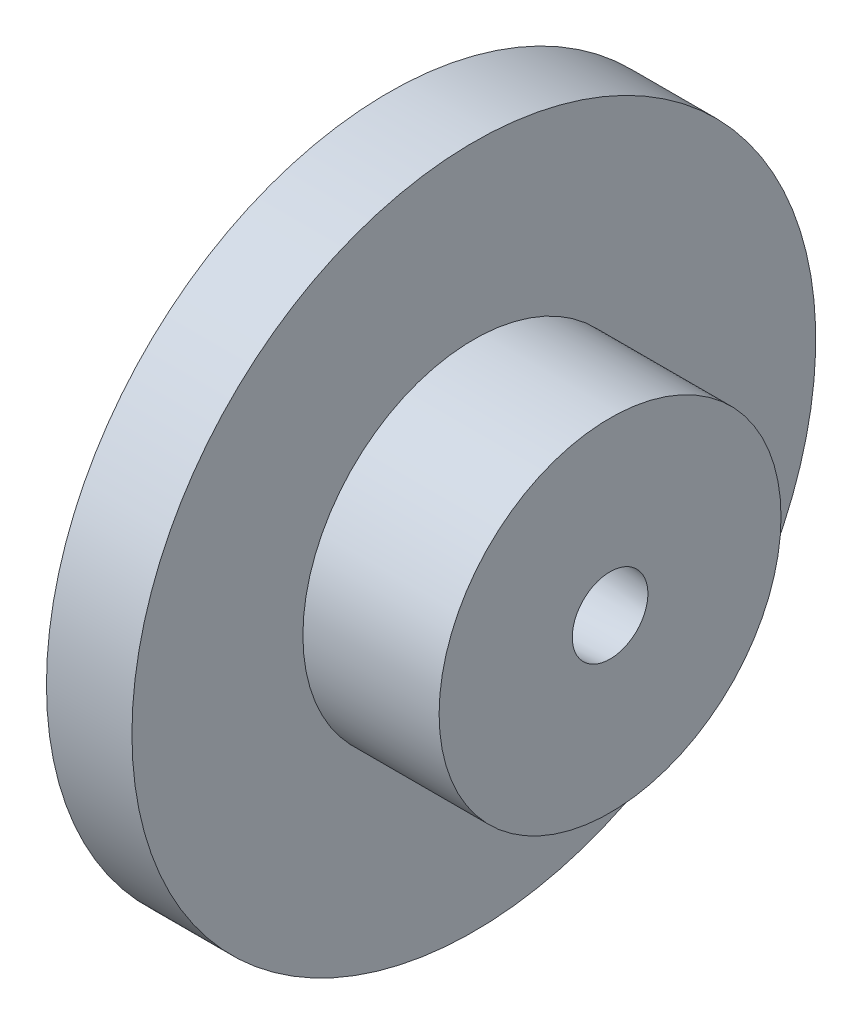
ISO-10303-21;
HEADER;
FILE_DESCRIPTION(('STEP AP214'),'2;1');
FILE_NAME('part.step','',(''),(''),'','','');
FILE_SCHEMA(('AUTOMOTIVE_DESIGN { 1 0 10303 214 1 1 1 1 }'));
ENDSEC;
DATA;
#1=APPLICATION_CONTEXT('core data for automotive mechanical design processes');
#2=APPLICATION_PROTOCOL_DEFINITION('international standard','automotive_design',2000,#1);
#3=PRODUCT_CONTEXT('',#1,'mechanical');
#4=PRODUCT('Part','Part','',(#3));
#5=PRODUCT_RELATED_PRODUCT_CATEGORY('part','',(#4));
#6=PRODUCT_DEFINITION_FORMATION('','',#4);
#7=PRODUCT_DEFINITION_CONTEXT('part definition',#1,'design');
#8=PRODUCT_DEFINITION('design','',#6,#7);
#9=PRODUCT_DEFINITION_SHAPE('','',#8);
#10=(LENGTH_UNIT() NAMED_UNIT(*) SI_UNIT(.MILLI.,.METRE.));
#11=(NAMED_UNIT(*) PLANE_ANGLE_UNIT() SI_UNIT($,.RADIAN.));
#12=(NAMED_UNIT(*) SI_UNIT($,.STERADIAN.) SOLID_ANGLE_UNIT());
#13=UNCERTAINTY_MEASURE_WITH_UNIT(LENGTH_MEASURE(1.E-05),#10,'distance_accuracy_value','');
#14=(GEOMETRIC_REPRESENTATION_CONTEXT(3) GLOBAL_UNCERTAINTY_ASSIGNED_CONTEXT((#13)) GLOBAL_UNIT_ASSIGNED_CONTEXT((#10,
#11,#12)) REPRESENTATION_CONTEXT('',''));
#15=CARTESIAN_POINT('',(0.,0.,0.));
#16=DIRECTION('',(0.,0.,1.));
#17=DIRECTION('',(1.,0.,0.));
#18=AXIS2_PLACEMENT_3D('',#15,#16,#17);
#19=CARTESIAN_POINT('',(0.,0.,0.));
#20=DIRECTION('',(-1.,0.,0.));
#21=DIRECTION('',(0.,0.,1.));
#22=AXIS2_PLACEMENT_3D('',#19,#20,#21);
#23=CONICAL_SURFACE('',#22,8.500000018,0.0872664625997096);
#24=CARTESIAN_POINT('',(32.939999906,0.,0.));
#25=DIRECTION('',(-1.,0.,0.));
#26=DIRECTION('',(0.,0.,1.));
#27=AXIS2_PLACEMENT_3D('',#24,#25,#26);
#28=CIRCLE('',#27,5.61812344968023);
#29=CARTESIAN_POINT('',(32.939999906,0.,5.61812344968023));
#30=VERTEX_POINT('',#29);
#31=EDGE_CURVE('E62',#30,#30,#28,.T.);
#32=ORIENTED_EDGE('',*,*,#31,.F.);
#33=EDGE_LOOP('',(#32));
#34=FACE_BOUND('',#33,.T.);
#35=CARTESIAN_POINT('',(0.,0.,0.));
#36=DIRECTION('',(-1.,0.,0.));
#37=DIRECTION('',(0.,0.,1.));
#38=AXIS2_PLACEMENT_3D('',#35,#36,#37);
#39=CIRCLE('',#38,8.500000018);
#40=CARTESIAN_POINT('',(0.,0.,8.500000018));
#41=VERTEX_POINT('',#40);
#42=EDGE_CURVE('E10',#41,#41,#39,.T.);
#43=ORIENTED_EDGE('',*,*,#42,.T.);
#44=EDGE_LOOP('',(#43));
#45=FACE_BOUND('',#44,.T.);
#46=ADVANCED_FACE('F40',(#34,#45),#23,.F.);
#47=CARTESIAN_POINT('',(0.,8.500000018,0.));
#48=DIRECTION('',(1.,0.,0.));
#49=DIRECTION('',(0.,0.,-1.));
#50=AXIS2_PLACEMENT_3D('',#47,#48,#49);
#51=PLANE('',#50);
#52=ORIENTED_EDGE('',*,*,#42,.F.);
#53=EDGE_LOOP('',(#52));
#54=FACE_BOUND('',#53,.T.);
#55=CARTESIAN_POINT('',(0.,0.,0.));
#56=DIRECTION('',(-1.,0.,0.));
#57=DIRECTION('',(0.,0.,1.));
#58=AXIS2_PLACEMENT_3D('',#55,#56,#57);
#59=CIRCLE('',#58,50.8);
#60=CARTESIAN_POINT('',(0.,0.,50.8));
#61=VERTEX_POINT('',#60);
#62=EDGE_CURVE('E46',#61,#61,#59,.T.);
#63=ORIENTED_EDGE('',*,*,#62,.T.);
#64=EDGE_LOOP('',(#63));
#65=FACE_BOUND('',#64,.T.);
#66=ADVANCED_FACE('F69',(#54,#65),#51,.F.);
#67=CARTESIAN_POINT('',(0.,0.,0.));
#68=DIRECTION('',(-1.,0.,0.));
#69=DIRECTION('',(0.,0.,1.));
#70=AXIS2_PLACEMENT_3D('',#67,#68,#69);
#71=CYLINDRICAL_SURFACE('',#70,50.8);
#72=ORIENTED_EDGE('',*,*,#62,.F.);
#73=EDGE_LOOP('',(#72));
#74=FACE_BOUND('',#73,.T.);
#75=CARTESIAN_POINT('',(12.7,0.,0.));
#76=DIRECTION('',(-1.,0.,0.));
#77=DIRECTION('',(0.,0.,1.));
#78=AXIS2_PLACEMENT_3D('',#75,#76,#77);
#79=CIRCLE('',#78,50.8);
#80=CARTESIAN_POINT('',(12.7,0.,50.8));
#81=VERTEX_POINT('',#80);
#82=EDGE_CURVE('E50',#81,#81,#79,.T.);
#83=ORIENTED_EDGE('',*,*,#82,.T.);
#84=EDGE_LOOP('',(#83));
#85=FACE_BOUND('',#84,.T.);
#86=ADVANCED_FACE('F73',(#74,#85),#71,.T.);
#87=CARTESIAN_POINT('',(12.7,50.8,0.));
#88=DIRECTION('',(-1.,0.,0.));
#89=DIRECTION('',(0.,0.,1.));
#90=AXIS2_PLACEMENT_3D('',#87,#88,#89);
#91=PLANE('',#90);
#92=ORIENTED_EDGE('',*,*,#82,.F.);
#93=EDGE_LOOP('',(#92));
#94=FACE_BOUND('',#93,.T.);
#95=CARTESIAN_POINT('',(12.7,0.,0.));
#96=DIRECTION('',(-1.,0.,0.));
#97=DIRECTION('',(0.,0.,1.));
#98=AXIS2_PLACEMENT_3D('',#95,#96,#97);
#99=CIRCLE('',#98,25.4);
#100=CARTESIAN_POINT('',(12.7,0.,25.4));
#101=VERTEX_POINT('',#100);
#102=EDGE_CURVE('E54',#101,#101,#99,.T.);
#103=ORIENTED_EDGE('',*,*,#102,.T.);
#104=EDGE_LOOP('',(#103));
#105=FACE_BOUND('',#104,.T.);
#106=ADVANCED_FACE('F78',(#94,#105),#91,.F.);
#107=CARTESIAN_POINT('',(0.,0.,0.));
#108=DIRECTION('',(-1.,0.,0.));
#109=DIRECTION('',(0.,0.,1.));
#110=AXIS2_PLACEMENT_3D('',#107,#108,#109);
#111=CYLINDRICAL_SURFACE('',#110,25.4);
#112=ORIENTED_EDGE('',*,*,#102,.F.);
#113=EDGE_LOOP('',(#112));
#114=FACE_BOUND('',#113,.T.);
#115=CARTESIAN_POINT('',(32.939999906,0.,0.));
#116=DIRECTION('',(-1.,0.,0.));
#117=DIRECTION('',(0.,0.,1.));
#118=AXIS2_PLACEMENT_3D('',#115,#116,#117);
#119=CIRCLE('',#118,25.4);
#120=CARTESIAN_POINT('',(32.939999906,0.,25.4));
#121=VERTEX_POINT('',#120);
#122=EDGE_CURVE('E59',#121,#121,#119,.T.);
#123=ORIENTED_EDGE('',*,*,#122,.T.);
#124=EDGE_LOOP('',(#123));
#125=FACE_BOUND('',#124,.T.);
#126=ADVANCED_FACE('F84',(#114,#125),#111,.T.);
#127=CARTESIAN_POINT('',(32.939999906,25.4,0.));
#128=DIRECTION('',(-1.,0.,0.));
#129=DIRECTION('',(0.,0.,1.));
#130=AXIS2_PLACEMENT_3D('',#127,#128,#129);
#131=PLANE('',#130);
#132=ORIENTED_EDGE('',*,*,#122,.F.);
#133=EDGE_LOOP('',(#132));
#134=FACE_BOUND('',#133,.T.);
#135=ORIENTED_EDGE('',*,*,#31,.T.);
#136=EDGE_LOOP('',(#135));
#137=FACE_BOUND('',#136,.T.);
#138=ADVANCED_FACE('F66',(#134,#137),#131,.F.);
#139=CLOSED_SHELL('',(#46,#66,#86,#106,#126,#138));
#140=MANIFOLD_SOLID_BREP('B2',#139);
#141=ADVANCED_BREP_SHAPE_REPRESENTATION('',(#18,#140),#14);
#142=SHAPE_DEFINITION_REPRESENTATION(#9,#141);
ENDSEC;
END-ISO-10303-21;
